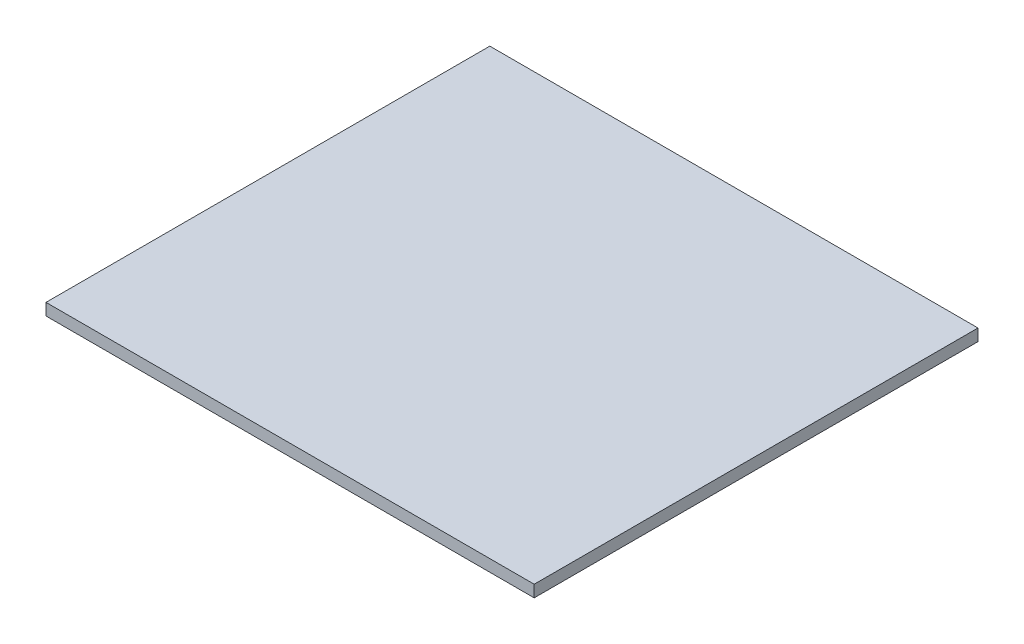
ISO-10303-21;
HEADER;
FILE_DESCRIPTION(('STEP AP214'),'2;1');
FILE_NAME('part.step','',(''),(''),'','','');
FILE_SCHEMA(('AUTOMOTIVE_DESIGN { 1 0 10303 214 1 1 1 1 }'));
ENDSEC;
DATA;
#1=APPLICATION_CONTEXT('core data for automotive mechanical design processes');
#2=APPLICATION_PROTOCOL_DEFINITION('international standard','automotive_design',2000,#1);
#3=PRODUCT_CONTEXT('',#1,'mechanical');
#4=PRODUCT('Part','Part','',(#3));
#5=PRODUCT_RELATED_PRODUCT_CATEGORY('part','',(#4));
#6=PRODUCT_DEFINITION_FORMATION('','',#4);
#7=PRODUCT_DEFINITION_CONTEXT('part definition',#1,'design');
#8=PRODUCT_DEFINITION('design','',#6,#7);
#9=PRODUCT_DEFINITION_SHAPE('','',#8);
#10=(LENGTH_UNIT() NAMED_UNIT(*) SI_UNIT(.MILLI.,.METRE.));
#11=(NAMED_UNIT(*) PLANE_ANGLE_UNIT() SI_UNIT($,.RADIAN.));
#12=(NAMED_UNIT(*) SI_UNIT($,.STERADIAN.) SOLID_ANGLE_UNIT());
#13=UNCERTAINTY_MEASURE_WITH_UNIT(LENGTH_MEASURE(1.E-05),#10,'distance_accuracy_value','');
#14=(GEOMETRIC_REPRESENTATION_CONTEXT(3) GLOBAL_UNCERTAINTY_ASSIGNED_CONTEXT((#13)) GLOBAL_UNIT_ASSIGNED_CONTEXT((#10,
#11,#12)) REPRESENTATION_CONTEXT('',''));
#15=CARTESIAN_POINT('',(0.,0.,0.));
#16=DIRECTION('',(0.,0.,1.));
#17=DIRECTION('',(1.,0.,0.));
#18=AXIS2_PLACEMENT_3D('',#15,#16,#17);
#19=CARTESIAN_POINT('',(0.,4.,0.));
#20=DIRECTION('',(1.,0.,0.));
#21=DIRECTION('',(0.,0.,-1.));
#22=AXIS2_PLACEMENT_3D('',#19,#20,#21);
#23=PLANE('',#22);
#24=DIRECTION('',(0.,0.,1.));
#25=VECTOR('',#24,1.);
#26=CARTESIAN_POINT('',(0.,0.,0.));
#27=LINE('',#26,#25);
#28=CARTESIAN_POINT('',(0.,0.,-150.));
#29=VERTEX_POINT('',#28);
#30=CARTESIAN_POINT('',(0.,0.,0.));
#31=VERTEX_POINT('',#30);
#32=EDGE_CURVE('E99',#29,#31,#27,.T.);
#33=ORIENTED_EDGE('',*,*,#32,.T.);
#34=DIRECTION('',(0.,-1.,0.));
#35=VECTOR('',#34,1.);
#36=CARTESIAN_POINT('',(0.,4.,0.));
#37=LINE('',#36,#35);
#38=CARTESIAN_POINT('',(0.,4.,0.));
#39=VERTEX_POINT('',#38);
#40=EDGE_CURVE('E11',#39,#31,#37,.T.);
#41=ORIENTED_EDGE('',*,*,#40,.F.);
#42=DIRECTION('',(0.,0.,1.));
#43=VECTOR('',#42,1.);
#44=CARTESIAN_POINT('',(0.,4.,0.));
#45=LINE('',#44,#43);
#46=CARTESIAN_POINT('',(0.,4.,-150.));
#47=VERTEX_POINT('',#46);
#48=EDGE_CURVE('E87',#47,#39,#45,.T.);
#49=ORIENTED_EDGE('',*,*,#48,.F.);
#50=DIRECTION('',(0.,-1.,0.));
#51=VECTOR('',#50,1.);
#52=CARTESIAN_POINT('',(0.,4.,-150.));
#53=LINE('',#52,#51);
#54=EDGE_CURVE('E95',#47,#29,#53,.T.);
#55=ORIENTED_EDGE('',*,*,#54,.T.);
#56=EDGE_LOOP('',(#33,#41,#49,#55));
#57=FACE_BOUND('',#56,.T.);
#58=ADVANCED_FACE('F36',(#57),#23,.F.);
#59=CARTESIAN_POINT('',(0.,4.,0.));
#60=DIRECTION('',(0.,0.,-1.));
#61=DIRECTION('',(-1.,0.,0.));
#62=AXIS2_PLACEMENT_3D('',#59,#60,#61);
#63=PLANE('',#62);
#64=DIRECTION('',(1.,0.,0.));
#65=VECTOR('',#64,1.);
#66=CARTESIAN_POINT('',(0.,0.,0.));
#67=LINE('',#66,#65);
#68=CARTESIAN_POINT('',(165.,0.,0.));
#69=VERTEX_POINT('',#68);
#70=EDGE_CURVE('E91',#31,#69,#67,.T.);
#71=ORIENTED_EDGE('',*,*,#70,.T.);
#72=DIRECTION('',(0.,-1.,0.));
#73=VECTOR('',#72,1.);
#74=CARTESIAN_POINT('',(165.,4.,0.));
#75=LINE('',#74,#73);
#76=CARTESIAN_POINT('',(165.,4.,0.));
#77=VERTEX_POINT('',#76);
#78=EDGE_CURVE('E44',#77,#69,#75,.T.);
#79=ORIENTED_EDGE('',*,*,#78,.F.);
#80=DIRECTION('',(1.,0.,0.));
#81=VECTOR('',#80,1.);
#82=CARTESIAN_POINT('',(0.,4.,0.));
#83=LINE('',#82,#81);
#84=EDGE_CURVE('E82',#39,#77,#83,.T.);
#85=ORIENTED_EDGE('',*,*,#84,.F.);
#86=ORIENTED_EDGE('',*,*,#40,.T.);
#87=EDGE_LOOP('',(#71,#79,#85,#86));
#88=FACE_BOUND('',#87,.T.);
#89=ADVANCED_FACE('F90',(#88),#63,.F.);
#90=CARTESIAN_POINT('',(165.,4.,0.));
#91=DIRECTION('',(-1.,0.,0.));
#92=DIRECTION('',(0.,0.,1.));
#93=AXIS2_PLACEMENT_3D('',#90,#91,#92);
#94=PLANE('',#93);
#95=DIRECTION('',(0.,0.,-1.));
#96=VECTOR('',#95,1.);
#97=CARTESIAN_POINT('',(165.,0.,0.));
#98=LINE('',#97,#96);
#99=CARTESIAN_POINT('',(165.,0.,-150.));
#100=VERTEX_POINT('',#99);
#101=EDGE_CURVE('E69',#69,#100,#98,.T.);
#102=ORIENTED_EDGE('',*,*,#101,.T.);
#103=DIRECTION('',(0.,-1.,0.));
#104=VECTOR('',#103,1.);
#105=CARTESIAN_POINT('',(165.,4.,-150.));
#106=LINE('',#105,#104);
#107=CARTESIAN_POINT('',(165.,4.,-150.));
#108=VERTEX_POINT('',#107);
#109=EDGE_CURVE('E92',#108,#100,#106,.T.);
#110=ORIENTED_EDGE('',*,*,#109,.F.);
#111=DIRECTION('',(0.,0.,-1.));
#112=VECTOR('',#111,1.);
#113=CARTESIAN_POINT('',(165.,4.,0.));
#114=LINE('',#113,#112);
#115=EDGE_CURVE('E85',#77,#108,#114,.T.);
#116=ORIENTED_EDGE('',*,*,#115,.F.);
#117=ORIENTED_EDGE('',*,*,#78,.T.);
#118=EDGE_LOOP('',(#102,#110,#116,#117));
#119=FACE_BOUND('',#118,.T.);
#120=ADVANCED_FACE('F93',(#119),#94,.F.);
#121=CARTESIAN_POINT('',(0.,4.,-150.));
#122=DIRECTION('',(0.,0.,1.));
#123=DIRECTION('',(1.,0.,0.));
#124=AXIS2_PLACEMENT_3D('',#121,#122,#123);
#125=PLANE('',#124);
#126=DIRECTION('',(-1.,0.,0.));
#127=VECTOR('',#126,1.);
#128=CARTESIAN_POINT('',(0.,0.,-150.));
#129=LINE('',#128,#127);
#130=EDGE_CURVE('E75',#100,#29,#129,.T.);
#131=ORIENTED_EDGE('',*,*,#130,.T.);
#132=ORIENTED_EDGE('',*,*,#54,.F.);
#133=DIRECTION('',(-1.,0.,0.));
#134=VECTOR('',#133,1.);
#135=CARTESIAN_POINT('',(0.,4.,-150.));
#136=LINE('',#135,#134);
#137=EDGE_CURVE('E52',#108,#47,#136,.T.);
#138=ORIENTED_EDGE('',*,*,#137,.F.);
#139=ORIENTED_EDGE('',*,*,#109,.T.);
#140=EDGE_LOOP('',(#131,#132,#138,#139));
#141=FACE_BOUND('',#140,.T.);
#142=ADVANCED_FACE('F106',(#141),#125,.F.);
#143=CARTESIAN_POINT('',(0.,4.,0.));
#144=DIRECTION('',(0.,-1.,0.));
#145=DIRECTION('',(0.,0.,-1.));
#146=AXIS2_PLACEMENT_3D('',#143,#144,#145);
#147=PLANE('',#146);
#148=ORIENTED_EDGE('',*,*,#48,.T.);
#149=ORIENTED_EDGE('',*,*,#84,.T.);
#150=ORIENTED_EDGE('',*,*,#115,.T.);
#151=ORIENTED_EDGE('',*,*,#137,.T.);
#152=EDGE_LOOP('',(#148,#149,#150,#151));
#153=FACE_BOUND('',#152,.T.);
#154=ADVANCED_FACE('F83',(#153),#147,.F.);
#155=CARTESIAN_POINT('',(0.,0.,0.));
#156=DIRECTION('',(0.,-1.,0.));
#157=DIRECTION('',(0.,0.,-1.));
#158=AXIS2_PLACEMENT_3D('',#155,#156,#157);
#159=PLANE('',#158);
#160=ORIENTED_EDGE('',*,*,#32,.F.);
#161=ORIENTED_EDGE('',*,*,#130,.F.);
#162=ORIENTED_EDGE('',*,*,#101,.F.);
#163=ORIENTED_EDGE('',*,*,#70,.F.);
#164=EDGE_LOOP('',(#160,#161,#162,#163));
#165=FACE_BOUND('',#164,.T.);
#166=ADVANCED_FACE('F109',(#165),#159,.T.);
#167=CLOSED_SHELL('',(#58,#89,#120,#142,#154,#166));
#168=MANIFOLD_SOLID_BREP('B2',#167);
#169=ADVANCED_BREP_SHAPE_REPRESENTATION('',(#18,#168),#14);
#170=SHAPE_DEFINITION_REPRESENTATION(#9,#169);
ENDSEC;
END-ISO-10303-21;
